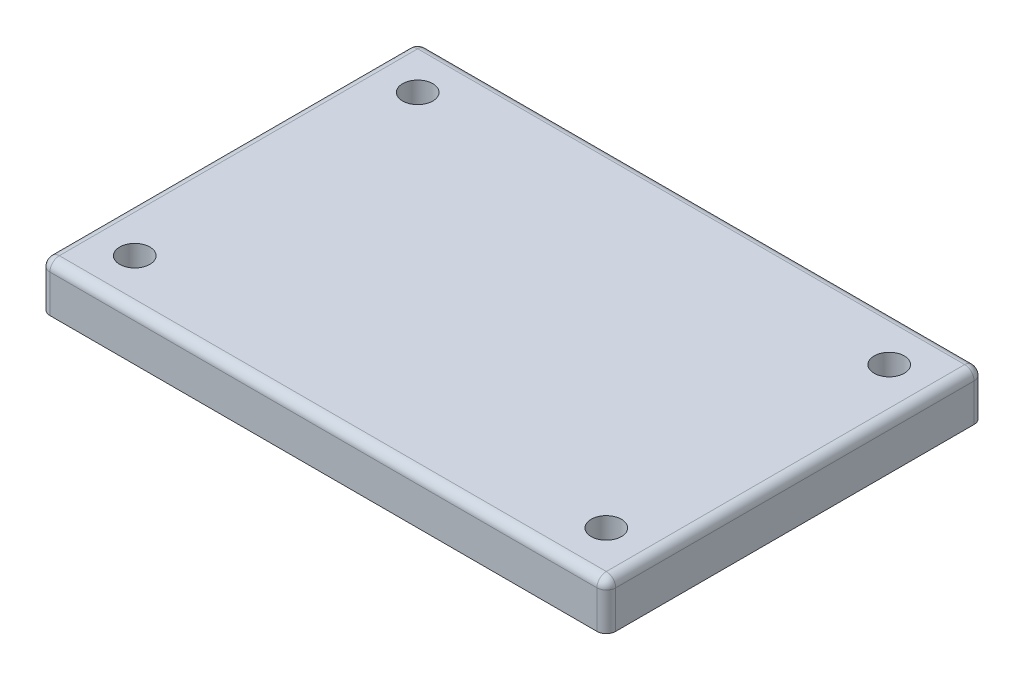
ISO-10303-21;
HEADER;
FILE_DESCRIPTION(('STEP AP214'),'2;1');
FILE_NAME('part.step','',(''),(''),'','','');
FILE_SCHEMA(('AUTOMOTIVE_DESIGN { 1 0 10303 214 1 1 1 1 }'));
ENDSEC;
DATA;
#1=APPLICATION_CONTEXT('core data for automotive mechanical design processes');
#2=APPLICATION_PROTOCOL_DEFINITION('international standard','automotive_design',2000,#1);
#3=PRODUCT_CONTEXT('',#1,'mechanical');
#4=PRODUCT('Part','Part','',(#3));
#5=PRODUCT_RELATED_PRODUCT_CATEGORY('part','',(#4));
#6=PRODUCT_DEFINITION_FORMATION('','',#4);
#7=PRODUCT_DEFINITION_CONTEXT('part definition',#1,'design');
#8=PRODUCT_DEFINITION('design','',#6,#7);
#9=PRODUCT_DEFINITION_SHAPE('','',#8);
#10=(LENGTH_UNIT() NAMED_UNIT(*) SI_UNIT(.MILLI.,.METRE.));
#11=(NAMED_UNIT(*) PLANE_ANGLE_UNIT() SI_UNIT($,.RADIAN.));
#12=(NAMED_UNIT(*) SI_UNIT($,.STERADIAN.) SOLID_ANGLE_UNIT());
#13=UNCERTAINTY_MEASURE_WITH_UNIT(LENGTH_MEASURE(1.E-05),#10,'distance_accuracy_value','');
#14=(GEOMETRIC_REPRESENTATION_CONTEXT(3) GLOBAL_UNCERTAINTY_ASSIGNED_CONTEXT((#13)) GLOBAL_UNIT_ASSIGNED_CONTEXT((#10,
#11,#12)) REPRESENTATION_CONTEXT('',''));
#15=CARTESIAN_POINT('',(0.,0.,0.));
#16=DIRECTION('',(0.,0.,1.));
#17=DIRECTION('',(1.,0.,0.));
#18=AXIS2_PLACEMENT_3D('',#15,#16,#17);
#19=CARTESIAN_POINT('',(30.,5.,-20.));
#20=DIRECTION('',(-1.,0.,0.));
#21=DIRECTION('',(0.,0.,1.));
#22=AXIS2_PLACEMENT_3D('',#19,#20,#21);
#23=PLANE('',#22);
#24=DIRECTION('',(0.,0.,-1.));
#25=VECTOR('',#24,1.);
#26=CARTESIAN_POINT('',(30.,0.,-20.));
#27=LINE('',#26,#25);
#28=CARTESIAN_POINT('',(30.,0.,19.));
#29=VERTEX_POINT('',#28);
#30=CARTESIAN_POINT('',(30.,0.,-19.));
#31=VERTEX_POINT('',#30);
#32=EDGE_CURVE('E213',#29,#31,#27,.T.);
#33=ORIENTED_EDGE('',*,*,#32,.T.);
#34=DIRECTION('',(0.,-1.,0.));
#35=VECTOR('',#34,1.);
#36=CARTESIAN_POINT('',(30.,5.,-19.));
#37=LINE('',#36,#35);
#38=CARTESIAN_POINT('',(30.,4.,-19.));
#39=VERTEX_POINT('',#38);
#40=EDGE_CURVE('E193',#31,#39,#37,.F.);
#41=ORIENTED_EDGE('',*,*,#40,.T.);
#42=DIRECTION('',(0.,0.,-1.));
#43=VECTOR('',#42,1.);
#44=CARTESIAN_POINT('',(30.,4.,20.));
#45=LINE('',#44,#43);
#46=CARTESIAN_POINT('',(30.,4.,19.));
#47=VERTEX_POINT('',#46);
#48=EDGE_CURVE('E163',#39,#47,#45,.F.);
#49=ORIENTED_EDGE('',*,*,#48,.T.);
#50=DIRECTION('',(0.,-1.,0.));
#51=VECTOR('',#50,1.);
#52=CARTESIAN_POINT('',(30.,5.,19.));
#53=LINE('',#52,#51);
#54=EDGE_CURVE('E191',#47,#29,#53,.T.);
#55=ORIENTED_EDGE('',*,*,#54,.T.);
#56=EDGE_LOOP('',(#33,#41,#49,#55));
#57=FACE_BOUND('',#56,.T.);
#58=ADVANCED_FACE('F35',(#57),#23,.F.);
#59=CARTESIAN_POINT('',(-30.,5.,-20.));
#60=DIRECTION('',(0.,0.,1.));
#61=DIRECTION('',(1.,0.,0.));
#62=AXIS2_PLACEMENT_3D('',#59,#60,#61);
#63=PLANE('',#62);
#64=DIRECTION('',(-1.,0.,0.));
#65=VECTOR('',#64,1.);
#66=CARTESIAN_POINT('',(-30.,0.,-20.));
#67=LINE('',#66,#65);
#68=CARTESIAN_POINT('',(29.,0.,-20.));
#69=VERTEX_POINT('',#68);
#70=CARTESIAN_POINT('',(-29.,0.,-20.));
#71=VERTEX_POINT('',#70);
#72=EDGE_CURVE('E220',#69,#71,#67,.T.);
#73=ORIENTED_EDGE('',*,*,#72,.T.);
#74=DIRECTION('',(0.,-1.,0.));
#75=VECTOR('',#74,1.);
#76=CARTESIAN_POINT('',(-29.,5.,-20.));
#77=LINE('',#76,#75);
#78=CARTESIAN_POINT('',(-29.,4.,-20.));
#79=VERTEX_POINT('',#78);
#80=EDGE_CURVE('E189',#71,#79,#77,.F.);
#81=ORIENTED_EDGE('',*,*,#80,.T.);
#82=DIRECTION('',(-1.,0.,0.));
#83=VECTOR('',#82,1.);
#84=CARTESIAN_POINT('',(30.,4.,-20.));
#85=LINE('',#84,#83);
#86=CARTESIAN_POINT('',(29.,4.,-20.));
#87=VERTEX_POINT('',#86);
#88=EDGE_CURVE('E157',#79,#87,#85,.F.);
#89=ORIENTED_EDGE('',*,*,#88,.T.);
#90=DIRECTION('',(0.,-1.,0.));
#91=VECTOR('',#90,1.);
#92=CARTESIAN_POINT('',(29.,5.,-20.));
#93=LINE('',#92,#91);
#94=EDGE_CURVE('E59',#87,#69,#93,.T.);
#95=ORIENTED_EDGE('',*,*,#94,.T.);
#96=EDGE_LOOP('',(#73,#81,#89,#95));
#97=FACE_BOUND('',#96,.T.);
#98=ADVANCED_FACE('F259',(#97),#63,.F.);
#99=CARTESIAN_POINT('',(-30.,5.,-20.));
#100=DIRECTION('',(1.,0.,0.));
#101=DIRECTION('',(0.,0.,-1.));
#102=AXIS2_PLACEMENT_3D('',#99,#100,#101);
#103=PLANE('',#102);
#104=DIRECTION('',(0.,0.,1.));
#105=VECTOR('',#104,1.);
#106=CARTESIAN_POINT('',(-30.,4.,-20.));
#107=LINE('',#106,#105);
#108=CARTESIAN_POINT('',(-30.,4.,19.));
#109=VERTEX_POINT('',#108);
#110=CARTESIAN_POINT('',(-30.,4.,-19.));
#111=VERTEX_POINT('',#110);
#112=EDGE_CURVE('E136',#109,#111,#107,.F.);
#113=ORIENTED_EDGE('',*,*,#112,.T.);
#114=DIRECTION('',(0.,-1.,0.));
#115=VECTOR('',#114,1.);
#116=CARTESIAN_POINT('',(-30.,5.,-19.));
#117=LINE('',#116,#115);
#118=CARTESIAN_POINT('',(-30.,0.,-19.));
#119=VERTEX_POINT('',#118);
#120=EDGE_CURVE('E179',#111,#119,#117,.T.);
#121=ORIENTED_EDGE('',*,*,#120,.T.);
#122=DIRECTION('',(0.,0.,1.));
#123=VECTOR('',#122,1.);
#124=CARTESIAN_POINT('',(-30.,0.,-20.));
#125=LINE('',#124,#123);
#126=CARTESIAN_POINT('',(-30.,0.,19.));
#127=VERTEX_POINT('',#126);
#128=EDGE_CURVE('E223',#119,#127,#125,.T.);
#129=ORIENTED_EDGE('',*,*,#128,.T.);
#130=DIRECTION('',(0.,-1.,0.));
#131=VECTOR('',#130,1.);
#132=CARTESIAN_POINT('',(-30.,5.,19.));
#133=LINE('',#132,#131);
#134=EDGE_CURVE('E177',#127,#109,#133,.F.);
#135=ORIENTED_EDGE('',*,*,#134,.T.);
#136=EDGE_LOOP('',(#113,#121,#129,#135));
#137=FACE_BOUND('',#136,.T.);
#138=ADVANCED_FACE('F265',(#137),#103,.F.);
#139=CARTESIAN_POINT('',(-30.,5.,20.));
#140=DIRECTION('',(0.,0.,-1.));
#141=DIRECTION('',(-1.,0.,0.));
#142=AXIS2_PLACEMENT_3D('',#139,#140,#141);
#143=PLANE('',#142);
#144=DIRECTION('',(1.,0.,0.));
#145=VECTOR('',#144,1.);
#146=CARTESIAN_POINT('',(-30.,0.,20.));
#147=LINE('',#146,#145);
#148=CARTESIAN_POINT('',(-29.,0.,20.));
#149=VERTEX_POINT('',#148);
#150=CARTESIAN_POINT('',(29.,0.,20.));
#151=VERTEX_POINT('',#150);
#152=EDGE_CURVE('E149',#149,#151,#147,.T.);
#153=ORIENTED_EDGE('',*,*,#152,.T.);
#154=DIRECTION('',(0.,-1.,0.));
#155=VECTOR('',#154,1.);
#156=CARTESIAN_POINT('',(29.,5.,20.));
#157=LINE('',#156,#155);
#158=CARTESIAN_POINT('',(29.,4.,20.));
#159=VERTEX_POINT('',#158);
#160=EDGE_CURVE('E11',#151,#159,#157,.F.);
#161=ORIENTED_EDGE('',*,*,#160,.T.);
#162=DIRECTION('',(1.,0.,0.));
#163=VECTOR('',#162,1.);
#164=CARTESIAN_POINT('',(-30.,4.,20.));
#165=LINE('',#164,#163);
#166=CARTESIAN_POINT('',(-29.,4.,20.));
#167=VERTEX_POINT('',#166);
#168=EDGE_CURVE('E138',#159,#167,#165,.F.);
#169=ORIENTED_EDGE('',*,*,#168,.T.);
#170=DIRECTION('',(0.,-1.,0.));
#171=VECTOR('',#170,1.);
#172=CARTESIAN_POINT('',(-29.,5.,20.));
#173=LINE('',#172,#171);
#174=EDGE_CURVE('E44',#167,#149,#173,.T.);
#175=ORIENTED_EDGE('',*,*,#174,.T.);
#176=EDGE_LOOP('',(#153,#161,#169,#175));
#177=FACE_BOUND('',#176,.T.);
#178=ADVANCED_FACE('F364',(#177),#143,.F.);
#179=CARTESIAN_POINT('',(0.,5.,0.));
#180=DIRECTION('',(0.,1.,0.));
#181=DIRECTION('',(0.,0.,1.));
#182=AXIS2_PLACEMENT_3D('',#179,#180,#181);
#183=PLANE('',#182);
#184=DIRECTION('',(-1.,0.,0.));
#185=VECTOR('',#184,1.);
#186=CARTESIAN_POINT('',(-30.,5.,-19.));
#187=LINE('',#186,#185);
#188=CARTESIAN_POINT('',(29.,5.,-19.));
#189=VERTEX_POINT('',#188);
#190=CARTESIAN_POINT('',(-29.,5.,-19.));
#191=VERTEX_POINT('',#190);
#192=EDGE_CURVE('E155',#189,#191,#187,.T.);
#193=ORIENTED_EDGE('',*,*,#192,.T.);
#194=DIRECTION('',(0.,0.,1.));
#195=VECTOR('',#194,1.);
#196=CARTESIAN_POINT('',(-29.,5.,20.));
#197=LINE('',#196,#195);
#198=CARTESIAN_POINT('',(-29.,5.,19.));
#199=VERTEX_POINT('',#198);
#200=EDGE_CURVE('E133',#191,#199,#197,.T.);
#201=ORIENTED_EDGE('',*,*,#200,.T.);
#202=DIRECTION('',(1.,0.,0.));
#203=VECTOR('',#202,1.);
#204=CARTESIAN_POINT('',(30.,5.,19.));
#205=LINE('',#204,#203);
#206=CARTESIAN_POINT('',(29.,5.,19.));
#207=VERTEX_POINT('',#206);
#208=EDGE_CURVE('E142',#199,#207,#205,.T.);
#209=ORIENTED_EDGE('',*,*,#208,.T.);
#210=DIRECTION('',(0.,0.,-1.));
#211=VECTOR('',#210,1.);
#212=CARTESIAN_POINT('',(29.,5.,-20.));
#213=LINE('',#212,#211);
#214=EDGE_CURVE('E148',#207,#189,#213,.T.);
#215=ORIENTED_EDGE('',*,*,#214,.T.);
#216=EDGE_LOOP('',(#193,#201,#209,#215));
#217=FACE_BOUND('',#216,.T.);
#218=CARTESIAN_POINT('',(-25.,5.,15.));
#219=DIRECTION('',(0.,1.,0.));
#220=DIRECTION('',(0.,0.,1.));
#221=AXIS2_PLACEMENT_3D('',#218,#219,#220);
#222=CIRCLE('',#221,1.6);
#223=CARTESIAN_POINT('',(-25.,5.,16.6));
#224=VERTEX_POINT('',#223);
#225=EDGE_CURVE('E198',#224,#224,#222,.T.);
#226=ORIENTED_EDGE('',*,*,#225,.F.);
#227=EDGE_LOOP('',(#226));
#228=FACE_BOUND('',#227,.T.);
#229=CARTESIAN_POINT('',(25.,5.,15.));
#230=DIRECTION('',(0.,1.,0.));
#231=DIRECTION('',(0.,0.,1.));
#232=AXIS2_PLACEMENT_3D('',#229,#230,#231);
#233=CIRCLE('',#232,1.6);
#234=CARTESIAN_POINT('',(25.,5.,16.6));
#235=VERTEX_POINT('',#234);
#236=EDGE_CURVE('E399',#235,#235,#233,.T.);
#237=ORIENTED_EDGE('',*,*,#236,.F.);
#238=EDGE_LOOP('',(#237));
#239=FACE_BOUND('',#238,.T.);
#240=CARTESIAN_POINT('',(25.,5.,-15.));
#241=DIRECTION('',(0.,1.,0.));
#242=DIRECTION('',(0.,0.,1.));
#243=AXIS2_PLACEMENT_3D('',#240,#241,#242);
#244=CIRCLE('',#243,1.6);
#245=CARTESIAN_POINT('',(25.,5.,-13.4));
#246=VERTEX_POINT('',#245);
#247=EDGE_CURVE('E393',#246,#246,#244,.T.);
#248=ORIENTED_EDGE('',*,*,#247,.F.);
#249=EDGE_LOOP('',(#248));
#250=FACE_BOUND('',#249,.T.);
#251=CARTESIAN_POINT('',(-25.,5.,-15.));
#252=DIRECTION('',(0.,1.,0.));
#253=DIRECTION('',(0.,0.,1.));
#254=AXIS2_PLACEMENT_3D('',#251,#252,#253);
#255=CIRCLE('',#254,1.6);
#256=CARTESIAN_POINT('',(-25.,5.,-13.4));
#257=VERTEX_POINT('',#256);
#258=EDGE_CURVE('E226',#257,#257,#255,.T.);
#259=ORIENTED_EDGE('',*,*,#258,.F.);
#260=EDGE_LOOP('',(#259));
#261=FACE_BOUND('',#260,.T.);
#262=ADVANCED_FACE('F152',(#217,#228,#239,#250,#261),#183,.T.);
#263=CARTESIAN_POINT('',(0.,0.,0.));
#264=DIRECTION('',(0.,1.,0.));
#265=DIRECTION('',(0.,0.,1.));
#266=AXIS2_PLACEMENT_3D('',#263,#264,#265);
#267=PLANE('',#266);
#268=CARTESIAN_POINT('',(-25.,0.,15.));
#269=DIRECTION('',(0.,1.,0.));
#270=DIRECTION('',(0.,0.,1.));
#271=AXIS2_PLACEMENT_3D('',#268,#269,#270);
#272=CIRCLE('',#271,1.6);
#273=CARTESIAN_POINT('',(-25.,0.,16.6));
#274=VERTEX_POINT('',#273);
#275=EDGE_CURVE('E404',#274,#274,#272,.T.);
#276=ORIENTED_EDGE('',*,*,#275,.T.);
#277=EDGE_LOOP('',(#276));
#278=FACE_BOUND('',#277,.T.);
#279=CARTESIAN_POINT('',(25.,0.,15.));
#280=DIRECTION('',(0.,1.,0.));
#281=DIRECTION('',(0.,0.,1.));
#282=AXIS2_PLACEMENT_3D('',#279,#280,#281);
#283=CIRCLE('',#282,1.6);
#284=CARTESIAN_POINT('',(25.,0.,16.6));
#285=VERTEX_POINT('',#284);
#286=EDGE_CURVE('E395',#285,#285,#283,.T.);
#287=ORIENTED_EDGE('',*,*,#286,.T.);
#288=EDGE_LOOP('',(#287));
#289=FACE_BOUND('',#288,.T.);
#290=CARTESIAN_POINT('',(25.,0.,-15.));
#291=DIRECTION('',(0.,1.,0.));
#292=DIRECTION('',(0.,0.,1.));
#293=AXIS2_PLACEMENT_3D('',#290,#291,#292);
#294=CIRCLE('',#293,1.6);
#295=CARTESIAN_POINT('',(25.,0.,-13.4));
#296=VERTEX_POINT('',#295);
#297=EDGE_CURVE('E390',#296,#296,#294,.T.);
#298=ORIENTED_EDGE('',*,*,#297,.T.);
#299=EDGE_LOOP('',(#298));
#300=FACE_BOUND('',#299,.T.);
#301=CARTESIAN_POINT('',(-25.,0.,-15.));
#302=DIRECTION('',(0.,1.,0.));
#303=DIRECTION('',(0.,0.,1.));
#304=AXIS2_PLACEMENT_3D('',#301,#302,#303);
#305=CIRCLE('',#304,1.6);
#306=CARTESIAN_POINT('',(-25.,0.,-13.4));
#307=VERTEX_POINT('',#306);
#308=EDGE_CURVE('E221',#307,#307,#305,.T.);
#309=ORIENTED_EDGE('',*,*,#308,.T.);
#310=EDGE_LOOP('',(#309));
#311=FACE_BOUND('',#310,.T.);
#312=ORIENTED_EDGE('',*,*,#128,.F.);
#313=CARTESIAN_POINT('',(-29.,0.,-19.));
#314=DIRECTION('',(0.,1.,0.));
#315=DIRECTION('',(0.,0.,1.));
#316=AXIS2_PLACEMENT_3D('',#313,#314,#315);
#317=CIRCLE('',#316,1.);
#318=EDGE_CURVE('E52',#119,#71,#317,.F.);
#319=ORIENTED_EDGE('',*,*,#318,.T.);
#320=ORIENTED_EDGE('',*,*,#72,.F.);
#321=CARTESIAN_POINT('',(29.,0.,-19.));
#322=DIRECTION('',(0.,1.,0.));
#323=DIRECTION('',(0.,0.,1.));
#324=AXIS2_PLACEMENT_3D('',#321,#322,#323);
#325=CIRCLE('',#324,1.);
#326=EDGE_CURVE('E185',#69,#31,#325,.F.);
#327=ORIENTED_EDGE('',*,*,#326,.T.);
#328=ORIENTED_EDGE('',*,*,#32,.F.);
#329=CARTESIAN_POINT('',(29.,0.,19.));
#330=DIRECTION('',(0.,1.,0.));
#331=DIRECTION('',(0.,0.,1.));
#332=AXIS2_PLACEMENT_3D('',#329,#330,#331);
#333=CIRCLE('',#332,1.);
#334=EDGE_CURVE('E183',#29,#151,#333,.F.);
#335=ORIENTED_EDGE('',*,*,#334,.T.);
#336=ORIENTED_EDGE('',*,*,#152,.F.);
#337=CARTESIAN_POINT('',(-29.,0.,19.));
#338=DIRECTION('',(0.,1.,0.));
#339=DIRECTION('',(0.,0.,1.));
#340=AXIS2_PLACEMENT_3D('',#337,#338,#339);
#341=CIRCLE('',#340,1.);
#342=EDGE_CURVE('E181',#149,#127,#341,.F.);
#343=ORIENTED_EDGE('',*,*,#342,.T.);
#344=EDGE_LOOP('',(#312,#319,#320,#327,#328,#335,#336,#343));
#345=FACE_BOUND('',#344,.T.);
#346=ADVANCED_FACE('F216',(#278,#289,#300,#311,#345),#267,.F.);
#347=CARTESIAN_POINT('',(-25.,0.,-15.));
#348=DIRECTION('',(0.,1.,0.));
#349=DIRECTION('',(0.,0.,1.));
#350=AXIS2_PLACEMENT_3D('',#347,#348,#349);
#351=CYLINDRICAL_SURFACE('',#350,1.6);
#352=ORIENTED_EDGE('',*,*,#308,.F.);
#353=EDGE_LOOP('',(#352));
#354=FACE_BOUND('',#353,.T.);
#355=ORIENTED_EDGE('',*,*,#258,.T.);
#356=EDGE_LOOP('',(#355));
#357=FACE_BOUND('',#356,.T.);
#358=ADVANCED_FACE('F372',(#354,#357),#351,.F.);
#359=CARTESIAN_POINT('',(25.,0.,-15.));
#360=DIRECTION('',(0.,1.,0.));
#361=DIRECTION('',(0.,0.,1.));
#362=AXIS2_PLACEMENT_3D('',#359,#360,#361);
#363=CYLINDRICAL_SURFACE('',#362,1.6);
#364=ORIENTED_EDGE('',*,*,#297,.F.);
#365=EDGE_LOOP('',(#364));
#366=FACE_BOUND('',#365,.T.);
#367=ORIENTED_EDGE('',*,*,#247,.T.);
#368=EDGE_LOOP('',(#367));
#369=FACE_BOUND('',#368,.T.);
#370=ADVANCED_FACE('F377',(#366,#369),#363,.F.);
#371=CARTESIAN_POINT('',(25.,0.,15.));
#372=DIRECTION('',(0.,1.,0.));
#373=DIRECTION('',(0.,0.,1.));
#374=AXIS2_PLACEMENT_3D('',#371,#372,#373);
#375=CYLINDRICAL_SURFACE('',#374,1.6);
#376=ORIENTED_EDGE('',*,*,#286,.F.);
#377=EDGE_LOOP('',(#376));
#378=FACE_BOUND('',#377,.T.);
#379=ORIENTED_EDGE('',*,*,#236,.T.);
#380=EDGE_LOOP('',(#379));
#381=FACE_BOUND('',#380,.T.);
#382=ADVANCED_FACE('F254',(#378,#381),#375,.F.);
#383=CARTESIAN_POINT('',(-25.,0.,15.));
#384=DIRECTION('',(0.,1.,0.));
#385=DIRECTION('',(0.,0.,1.));
#386=AXIS2_PLACEMENT_3D('',#383,#384,#385);
#387=CYLINDRICAL_SURFACE('',#386,1.6);
#388=ORIENTED_EDGE('',*,*,#275,.F.);
#389=EDGE_LOOP('',(#388));
#390=FACE_BOUND('',#389,.T.);
#391=ORIENTED_EDGE('',*,*,#225,.T.);
#392=EDGE_LOOP('',(#391));
#393=FACE_BOUND('',#392,.T.);
#394=ADVANCED_FACE('F246',(#390,#393),#387,.F.);
#395=CARTESIAN_POINT('',(29.,4.,0.));
#396=DIRECTION('',(0.,0.,1.));
#397=DIRECTION('',(1.,0.,0.));
#398=AXIS2_PLACEMENT_3D('',#395,#396,#397);
#399=CYLINDRICAL_SURFACE('',#398,1.);
#400=ORIENTED_EDGE('',*,*,#48,.F.);
#401=CARTESIAN_POINT('',(29.,4.,-19.));
#402=DIRECTION('',(0.,0.,1.));
#403=DIRECTION('',(1.,0.,0.));
#404=AXIS2_PLACEMENT_3D('',#401,#402,#403);
#405=CIRCLE('',#404,1.);
#406=EDGE_CURVE('E125',#39,#189,#405,.T.);
#407=ORIENTED_EDGE('',*,*,#406,.T.);
#408=ORIENTED_EDGE('',*,*,#214,.F.);
#409=CARTESIAN_POINT('',(29.,4.,19.));
#410=DIRECTION('',(0.,0.,1.));
#411=DIRECTION('',(1.,0.,0.));
#412=AXIS2_PLACEMENT_3D('',#409,#410,#411);
#413=CIRCLE('',#412,1.);
#414=EDGE_CURVE('E173',#207,#47,#413,.F.);
#415=ORIENTED_EDGE('',*,*,#414,.T.);
#416=EDGE_LOOP('',(#400,#407,#408,#415));
#417=FACE_BOUND('',#416,.T.);
#418=ADVANCED_FACE('F244',(#417),#399,.T.);
#419=CARTESIAN_POINT('',(0.,4.,-19.));
#420=DIRECTION('',(1.,0.,0.));
#421=DIRECTION('',(0.,0.,-1.));
#422=AXIS2_PLACEMENT_3D('',#419,#420,#421);
#423=CYLINDRICAL_SURFACE('',#422,1.);
#424=ORIENTED_EDGE('',*,*,#88,.F.);
#425=CARTESIAN_POINT('',(-29.,4.,-19.));
#426=DIRECTION('',(1.,0.,0.));
#427=DIRECTION('',(0.,0.,-1.));
#428=AXIS2_PLACEMENT_3D('',#425,#426,#427);
#429=CIRCLE('',#428,1.);
#430=EDGE_CURVE('E171',#79,#191,#429,.T.);
#431=ORIENTED_EDGE('',*,*,#430,.T.);
#432=ORIENTED_EDGE('',*,*,#192,.F.);
#433=CARTESIAN_POINT('',(29.,4.,-19.));
#434=DIRECTION('',(1.,0.,0.));
#435=DIRECTION('',(0.,0.,-1.));
#436=AXIS2_PLACEMENT_3D('',#433,#434,#435);
#437=CIRCLE('',#436,1.);
#438=EDGE_CURVE('E168',#189,#87,#437,.F.);
#439=ORIENTED_EDGE('',*,*,#438,.T.);
#440=EDGE_LOOP('',(#424,#431,#432,#439));
#441=FACE_BOUND('',#440,.T.);
#442=ADVANCED_FACE('F236',(#441),#423,.T.);
#443=CARTESIAN_POINT('',(0.,4.,19.));
#444=DIRECTION('',(-1.,0.,0.));
#445=DIRECTION('',(0.,0.,1.));
#446=AXIS2_PLACEMENT_3D('',#443,#444,#445);
#447=CYLINDRICAL_SURFACE('',#446,1.);
#448=ORIENTED_EDGE('',*,*,#168,.F.);
#449=CARTESIAN_POINT('',(29.,4.,19.));
#450=DIRECTION('',(-1.,0.,0.));
#451=DIRECTION('',(0.,0.,1.));
#452=AXIS2_PLACEMENT_3D('',#449,#450,#451);
#453=CIRCLE('',#452,1.);
#454=EDGE_CURVE('E124',#159,#207,#453,.T.);
#455=ORIENTED_EDGE('',*,*,#454,.T.);
#456=ORIENTED_EDGE('',*,*,#208,.F.);
#457=CARTESIAN_POINT('',(-29.,4.,19.));
#458=DIRECTION('',(-1.,0.,0.));
#459=DIRECTION('',(0.,0.,1.));
#460=AXIS2_PLACEMENT_3D('',#457,#458,#459);
#461=CIRCLE('',#460,1.);
#462=EDGE_CURVE('E115',#199,#167,#461,.F.);
#463=ORIENTED_EDGE('',*,*,#462,.T.);
#464=EDGE_LOOP('',(#448,#455,#456,#463));
#465=FACE_BOUND('',#464,.T.);
#466=ADVANCED_FACE('F143',(#465),#447,.T.);
#467=CARTESIAN_POINT('',(-29.,4.,0.));
#468=DIRECTION('',(0.,0.,-1.));
#469=DIRECTION('',(-1.,0.,0.));
#470=AXIS2_PLACEMENT_3D('',#467,#468,#469);
#471=CYLINDRICAL_SURFACE('',#470,1.);
#472=ORIENTED_EDGE('',*,*,#200,.F.);
#473=CARTESIAN_POINT('',(-29.,4.,-19.));
#474=DIRECTION('',(0.,0.,-1.));
#475=DIRECTION('',(-1.,0.,0.));
#476=AXIS2_PLACEMENT_3D('',#473,#474,#475);
#477=CIRCLE('',#476,1.);
#478=EDGE_CURVE('E137',#191,#111,#477,.F.);
#479=ORIENTED_EDGE('',*,*,#478,.T.);
#480=ORIENTED_EDGE('',*,*,#112,.F.);
#481=CARTESIAN_POINT('',(-29.,4.,19.));
#482=DIRECTION('',(0.,0.,-1.));
#483=DIRECTION('',(-1.,0.,0.));
#484=AXIS2_PLACEMENT_3D('',#481,#482,#483);
#485=CIRCLE('',#484,1.);
#486=EDGE_CURVE('E118',#109,#199,#485,.T.);
#487=ORIENTED_EDGE('',*,*,#486,.T.);
#488=EDGE_LOOP('',(#472,#479,#480,#487));
#489=FACE_BOUND('',#488,.T.);
#490=ADVANCED_FACE('F130',(#489),#471,.T.);
#491=CARTESIAN_POINT('',(-29.,5.,-19.));
#492=DIRECTION('',(0.,-1.,0.));
#493=DIRECTION('',(0.,0.,-1.));
#494=AXIS2_PLACEMENT_3D('',#491,#492,#493);
#495=CYLINDRICAL_SURFACE('',#494,1.);
#496=ORIENTED_EDGE('',*,*,#318,.F.);
#497=ORIENTED_EDGE('',*,*,#120,.F.);
#498=CARTESIAN_POINT('',(-29.,4.,-19.));
#499=DIRECTION('',(0.,1.,0.));
#500=DIRECTION('',(0.,0.,1.));
#501=AXIS2_PLACEMENT_3D('',#498,#499,#500);
#502=CIRCLE('',#501,1.);
#503=EDGE_CURVE('E196',#79,#111,#502,.T.);
#504=ORIENTED_EDGE('',*,*,#503,.F.);
#505=ORIENTED_EDGE('',*,*,#80,.F.);
#506=EDGE_LOOP('',(#496,#497,#504,#505));
#507=FACE_BOUND('',#506,.T.);
#508=ADVANCED_FACE('F271',(#507),#495,.T.);
#509=CARTESIAN_POINT('',(-29.,4.,-19.));
#510=DIRECTION('',(0.,0.,1.));
#511=DIRECTION('',(1.,0.,0.));
#512=AXIS2_PLACEMENT_3D('',#509,#510,#511);
#513=SPHERICAL_SURFACE('',#512,1.);
#514=ORIENTED_EDGE('',*,*,#478,.F.);
#515=ORIENTED_EDGE('',*,*,#430,.F.);
#516=ORIENTED_EDGE('',*,*,#503,.T.);
#517=EDGE_LOOP('',(#514,#515,#516));
#518=FACE_BOUND('',#517,.T.);
#519=ADVANCED_FACE('F288',(#518),#513,.T.);
#520=CARTESIAN_POINT('',(29.,5.,-19.));
#521=DIRECTION('',(0.,-1.,0.));
#522=DIRECTION('',(0.,0.,-1.));
#523=AXIS2_PLACEMENT_3D('',#520,#521,#522);
#524=CYLINDRICAL_SURFACE('',#523,1.);
#525=ORIENTED_EDGE('',*,*,#326,.F.);
#526=ORIENTED_EDGE('',*,*,#94,.F.);
#527=CARTESIAN_POINT('',(29.,4.,-19.));
#528=DIRECTION('',(0.,1.,0.));
#529=DIRECTION('',(0.,0.,1.));
#530=AXIS2_PLACEMENT_3D('',#527,#528,#529);
#531=CIRCLE('',#530,1.);
#532=EDGE_CURVE('E199',#39,#87,#531,.T.);
#533=ORIENTED_EDGE('',*,*,#532,.F.);
#534=ORIENTED_EDGE('',*,*,#40,.F.);
#535=EDGE_LOOP('',(#525,#526,#533,#534));
#536=FACE_BOUND('',#535,.T.);
#537=ADVANCED_FACE('F243',(#536),#524,.T.);
#538=CARTESIAN_POINT('',(29.,4.,-19.));
#539=DIRECTION('',(0.,0.,1.));
#540=DIRECTION('',(1.,0.,0.));
#541=AXIS2_PLACEMENT_3D('',#538,#539,#540);
#542=SPHERICAL_SURFACE('',#541,1.);
#543=ORIENTED_EDGE('',*,*,#438,.F.);
#544=ORIENTED_EDGE('',*,*,#406,.F.);
#545=ORIENTED_EDGE('',*,*,#532,.T.);
#546=EDGE_LOOP('',(#543,#544,#545));
#547=FACE_BOUND('',#546,.T.);
#548=ADVANCED_FACE('F240',(#547),#542,.T.);
#549=CARTESIAN_POINT('',(29.,5.,19.));
#550=DIRECTION('',(0.,-1.,0.));
#551=DIRECTION('',(0.,0.,-1.));
#552=AXIS2_PLACEMENT_3D('',#549,#550,#551);
#553=CYLINDRICAL_SURFACE('',#552,1.);
#554=ORIENTED_EDGE('',*,*,#334,.F.);
#555=ORIENTED_EDGE('',*,*,#54,.F.);
#556=CARTESIAN_POINT('',(29.,4.,19.));
#557=DIRECTION('',(0.,1.,0.));
#558=DIRECTION('',(0.,0.,1.));
#559=AXIS2_PLACEMENT_3D('',#556,#557,#558);
#560=CIRCLE('',#559,1.);
#561=EDGE_CURVE('E200',#159,#47,#560,.T.);
#562=ORIENTED_EDGE('',*,*,#561,.F.);
#563=ORIENTED_EDGE('',*,*,#160,.F.);
#564=EDGE_LOOP('',(#554,#555,#562,#563));
#565=FACE_BOUND('',#564,.T.);
#566=ADVANCED_FACE('F209',(#565),#553,.T.);
#567=CARTESIAN_POINT('',(29.,4.,19.));
#568=DIRECTION('',(0.,0.,1.));
#569=DIRECTION('',(1.,0.,0.));
#570=AXIS2_PLACEMENT_3D('',#567,#568,#569);
#571=SPHERICAL_SURFACE('',#570,1.);
#572=ORIENTED_EDGE('',*,*,#561,.T.);
#573=ORIENTED_EDGE('',*,*,#414,.F.);
#574=ORIENTED_EDGE('',*,*,#454,.F.);
#575=EDGE_LOOP('',(#572,#573,#574));
#576=FACE_BOUND('',#575,.T.);
#577=ADVANCED_FACE('F204',(#576),#571,.T.);
#578=CARTESIAN_POINT('',(-29.,5.,19.));
#579=DIRECTION('',(0.,-1.,0.));
#580=DIRECTION('',(0.,0.,-1.));
#581=AXIS2_PLACEMENT_3D('',#578,#579,#580);
#582=CYLINDRICAL_SURFACE('',#581,1.);
#583=ORIENTED_EDGE('',*,*,#342,.F.);
#584=ORIENTED_EDGE('',*,*,#174,.F.);
#585=CARTESIAN_POINT('',(-29.,4.,19.));
#586=DIRECTION('',(0.,1.,0.));
#587=DIRECTION('',(0.,0.,1.));
#588=AXIS2_PLACEMENT_3D('',#585,#586,#587);
#589=CIRCLE('',#588,1.);
#590=EDGE_CURVE('E39',#109,#167,#589,.T.);
#591=ORIENTED_EDGE('',*,*,#590,.F.);
#592=ORIENTED_EDGE('',*,*,#134,.F.);
#593=EDGE_LOOP('',(#583,#584,#591,#592));
#594=FACE_BOUND('',#593,.T.);
#595=ADVANCED_FACE('F37',(#594),#582,.T.);
#596=CARTESIAN_POINT('',(-29.,4.,19.));
#597=DIRECTION('',(0.,0.,1.));
#598=DIRECTION('',(1.,0.,0.));
#599=AXIS2_PLACEMENT_3D('',#596,#597,#598);
#600=SPHERICAL_SURFACE('',#599,1.);
#601=ORIENTED_EDGE('',*,*,#590,.T.);
#602=ORIENTED_EDGE('',*,*,#462,.F.);
#603=ORIENTED_EDGE('',*,*,#486,.F.);
#604=EDGE_LOOP('',(#601,#602,#603));
#605=FACE_BOUND('',#604,.T.);
#606=ADVANCED_FACE('F117',(#605),#600,.T.);
#607=CLOSED_SHELL('',(#58,#98,#138,#178,#262,#346,#358,#370,#382,#394,#418,#442,#466,#490,#508,
#519,#537,#548,#566,#577,#595,#606));
#608=MANIFOLD_SOLID_BREP('B2',#607);
#609=ADVANCED_BREP_SHAPE_REPRESENTATION('',(#18,#608),#14);
#610=SHAPE_DEFINITION_REPRESENTATION(#9,#609);
ENDSEC;
END-ISO-10303-21;
